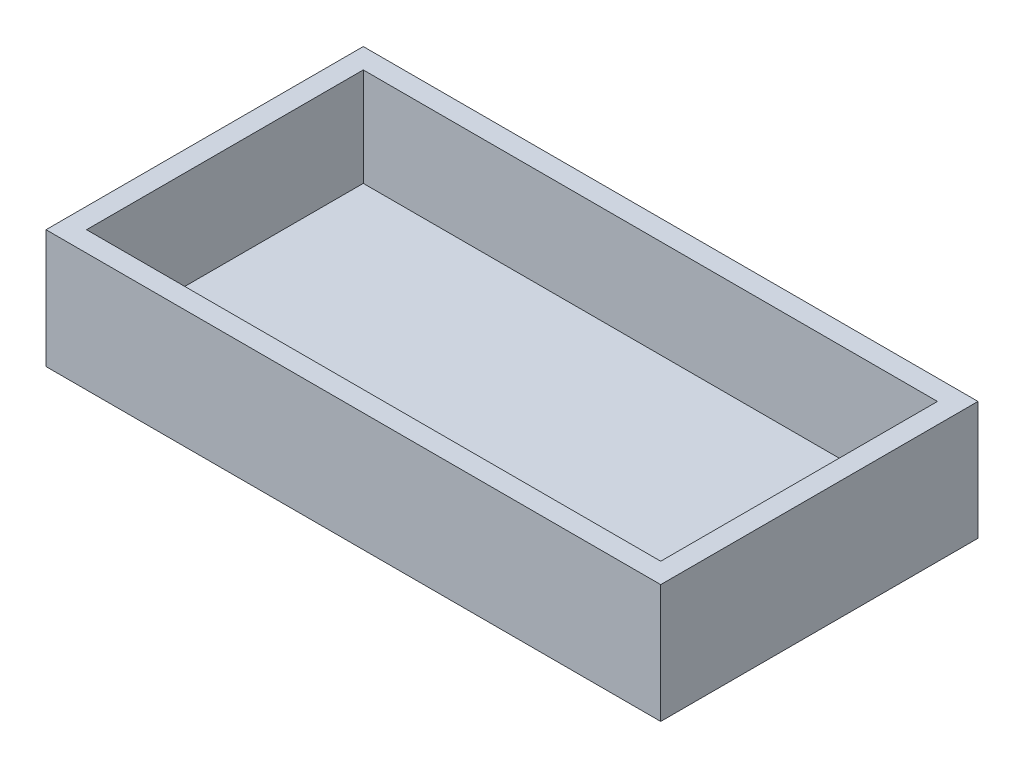
ISO-10303-21;
HEADER;
FILE_DESCRIPTION(('STEP AP214'),'2;1');
FILE_NAME('part.step','',(''),(''),'','','');
FILE_SCHEMA(('AUTOMOTIVE_DESIGN { 1 0 10303 214 1 1 1 1 }'));
ENDSEC;
DATA;
#1=APPLICATION_CONTEXT('core data for automotive mechanical design processes');
#2=APPLICATION_PROTOCOL_DEFINITION('international standard','automotive_design',2000,#1);
#3=PRODUCT_CONTEXT('',#1,'mechanical');
#4=PRODUCT('Part','Part','',(#3));
#5=PRODUCT_RELATED_PRODUCT_CATEGORY('part','',(#4));
#6=PRODUCT_DEFINITION_FORMATION('','',#4);
#7=PRODUCT_DEFINITION_CONTEXT('part definition',#1,'design');
#8=PRODUCT_DEFINITION('design','',#6,#7);
#9=PRODUCT_DEFINITION_SHAPE('','',#8);
#10=(LENGTH_UNIT() NAMED_UNIT(*) SI_UNIT(.MILLI.,.METRE.));
#11=(NAMED_UNIT(*) PLANE_ANGLE_UNIT() SI_UNIT($,.RADIAN.));
#12=(NAMED_UNIT(*) SI_UNIT($,.STERADIAN.) SOLID_ANGLE_UNIT());
#13=UNCERTAINTY_MEASURE_WITH_UNIT(LENGTH_MEASURE(1.E-05),#10,'distance_accuracy_value','');
#14=(GEOMETRIC_REPRESENTATION_CONTEXT(3) GLOBAL_UNCERTAINTY_ASSIGNED_CONTEXT((#13)) GLOBAL_UNIT_ASSIGNED_CONTEXT((#10,
#11,#12)) REPRESENTATION_CONTEXT('',''));
#15=CARTESIAN_POINT('',(0.,0.,0.));
#16=DIRECTION('',(0.,0.,1.));
#17=DIRECTION('',(1.,0.,0.));
#18=AXIS2_PLACEMENT_3D('',#15,#16,#17);
#19=CARTESIAN_POINT('',(0.,14.859,0.));
#20=DIRECTION('',(0.,-1.,0.));
#21=DIRECTION('',(0.,0.,-1.));
#22=AXIS2_PLACEMENT_3D('',#19,#20,#21);
#23=PLANE('',#22);
#24=DIRECTION('',(0.,0.,1.));
#25=VECTOR('',#24,1.);
#26=CARTESIAN_POINT('',(0.,14.859,0.));
#27=LINE('',#26,#25);
#28=CARTESIAN_POINT('',(0.,14.859,-39.7764));
#29=VERTEX_POINT('',#28);
#30=CARTESIAN_POINT('',(0.,14.859,0.));
#31=VERTEX_POINT('',#30);
#32=EDGE_CURVE('E142',#29,#31,#27,.T.);
#33=ORIENTED_EDGE('',*,*,#32,.T.);
#34=DIRECTION('',(1.,0.,0.));
#35=VECTOR('',#34,1.);
#36=CARTESIAN_POINT('',(0.,14.859,0.));
#37=LINE('',#36,#35);
#38=CARTESIAN_POINT('',(77.0636,14.859,0.));
#39=VERTEX_POINT('',#38);
#40=EDGE_CURVE('E86',#31,#39,#37,.T.);
#41=ORIENTED_EDGE('',*,*,#40,.T.);
#42=DIRECTION('',(0.,0.,-1.));
#43=VECTOR('',#42,1.);
#44=CARTESIAN_POINT('',(77.0636,14.859,0.));
#45=LINE('',#44,#43);
#46=CARTESIAN_POINT('',(77.0636,14.859,-39.7764));
#47=VERTEX_POINT('',#46);
#48=EDGE_CURVE('E145',#39,#47,#45,.T.);
#49=ORIENTED_EDGE('',*,*,#48,.T.);
#50=DIRECTION('',(-1.,0.,0.));
#51=VECTOR('',#50,1.);
#52=CARTESIAN_POINT('',(0.,14.859,-39.7764));
#53=LINE('',#52,#51);
#54=EDGE_CURVE('E58',#47,#29,#53,.T.);
#55=ORIENTED_EDGE('',*,*,#54,.T.);
#56=EDGE_LOOP('',(#33,#41,#49,#55));
#57=FACE_BOUND('',#56,.T.);
#58=DIRECTION('',(0.,0.,1.));
#59=VECTOR('',#58,1.);
#60=CARTESIAN_POINT('',(2.54,14.859,0.));
#61=LINE('',#60,#59);
#62=CARTESIAN_POINT('',(2.54,14.859,-37.2364));
#63=VERTEX_POINT('',#62);
#64=CARTESIAN_POINT('',(2.54,14.859,-2.54));
#65=VERTEX_POINT('',#64);
#66=EDGE_CURVE('E131',#63,#65,#61,.T.);
#67=ORIENTED_EDGE('',*,*,#66,.F.);
#68=DIRECTION('',(-1.,0.,0.));
#69=VECTOR('',#68,1.);
#70=CARTESIAN_POINT('',(0.,14.859,-37.2364));
#71=LINE('',#70,#69);
#72=CARTESIAN_POINT('',(74.5236,14.859,-37.2364));
#73=VERTEX_POINT('',#72);
#74=EDGE_CURVE('E140',#73,#63,#71,.T.);
#75=ORIENTED_EDGE('',*,*,#74,.F.);
#76=DIRECTION('',(0.,0.,-1.));
#77=VECTOR('',#76,1.);
#78=CARTESIAN_POINT('',(74.5236,14.859,0.));
#79=LINE('',#78,#77);
#80=CARTESIAN_POINT('',(74.5236,14.859,-2.54));
#81=VERTEX_POINT('',#80);
#82=EDGE_CURVE('E138',#81,#73,#79,.T.);
#83=ORIENTED_EDGE('',*,*,#82,.F.);
#84=DIRECTION('',(1.,0.,0.));
#85=VECTOR('',#84,1.);
#86=CARTESIAN_POINT('',(0.,14.859,-2.54));
#87=LINE('',#86,#85);
#88=EDGE_CURVE('E123',#65,#81,#87,.T.);
#89=ORIENTED_EDGE('',*,*,#88,.F.);
#90=EDGE_LOOP('',(#67,#75,#83,#89));
#91=FACE_BOUND('',#90,.T.);
#92=ADVANCED_FACE('F34',(#57,#91),#23,.F.);
#93=CARTESIAN_POINT('',(0.,14.859,0.));
#94=DIRECTION('',(1.,0.,0.));
#95=DIRECTION('',(0.,0.,-1.));
#96=AXIS2_PLACEMENT_3D('',#93,#94,#95);
#97=PLANE('',#96);
#98=DIRECTION('',(0.,0.,1.));
#99=VECTOR('',#98,1.);
#100=CARTESIAN_POINT('',(0.,0.,0.));
#101=LINE('',#100,#99);
#102=CARTESIAN_POINT('',(0.,0.,-39.7764));
#103=VERTEX_POINT('',#102);
#104=CARTESIAN_POINT('',(0.,0.,0.));
#105=VERTEX_POINT('',#104);
#106=EDGE_CURVE('E149',#103,#105,#101,.T.);
#107=ORIENTED_EDGE('',*,*,#106,.T.);
#108=DIRECTION('',(0.,-1.,0.));
#109=VECTOR('',#108,1.);
#110=CARTESIAN_POINT('',(0.,14.859,0.));
#111=LINE('',#110,#109);
#112=EDGE_CURVE('E11',#31,#105,#111,.T.);
#113=ORIENTED_EDGE('',*,*,#112,.F.);
#114=ORIENTED_EDGE('',*,*,#32,.F.);
#115=DIRECTION('',(0.,-1.,0.));
#116=VECTOR('',#115,1.);
#117=CARTESIAN_POINT('',(0.,14.859,-39.7764));
#118=LINE('',#117,#116);
#119=EDGE_CURVE('E148',#29,#103,#118,.T.);
#120=ORIENTED_EDGE('',*,*,#119,.T.);
#121=EDGE_LOOP('',(#107,#113,#114,#120));
#122=FACE_BOUND('',#121,.T.);
#123=ADVANCED_FACE('F36',(#122),#97,.F.);
#124=CARTESIAN_POINT('',(0.,14.859,0.));
#125=DIRECTION('',(0.,0.,-1.));
#126=DIRECTION('',(-1.,0.,0.));
#127=AXIS2_PLACEMENT_3D('',#124,#125,#126);
#128=PLANE('',#127);
#129=DIRECTION('',(1.,0.,0.));
#130=VECTOR('',#129,1.);
#131=CARTESIAN_POINT('',(0.,0.,0.));
#132=LINE('',#131,#130);
#133=CARTESIAN_POINT('',(77.0636,0.,0.));
#134=VERTEX_POINT('',#133);
#135=EDGE_CURVE('E152',#105,#134,#132,.T.);
#136=ORIENTED_EDGE('',*,*,#135,.T.);
#137=DIRECTION('',(0.,-1.,0.));
#138=VECTOR('',#137,1.);
#139=CARTESIAN_POINT('',(77.0636,14.859,0.));
#140=LINE('',#139,#138);
#141=EDGE_CURVE('E42',#39,#134,#140,.T.);
#142=ORIENTED_EDGE('',*,*,#141,.F.);
#143=ORIENTED_EDGE('',*,*,#40,.F.);
#144=ORIENTED_EDGE('',*,*,#112,.T.);
#145=EDGE_LOOP('',(#136,#142,#143,#144));
#146=FACE_BOUND('',#145,.T.);
#147=ADVANCED_FACE('F180',(#146),#128,.F.);
#148=CARTESIAN_POINT('',(77.0636,14.859,0.));
#149=DIRECTION('',(-1.,0.,0.));
#150=DIRECTION('',(0.,0.,1.));
#151=AXIS2_PLACEMENT_3D('',#148,#149,#150);
#152=PLANE('',#151);
#153=DIRECTION('',(0.,0.,-1.));
#154=VECTOR('',#153,1.);
#155=CARTESIAN_POINT('',(77.0636,0.,0.));
#156=LINE('',#155,#154);
#157=CARTESIAN_POINT('',(77.0636,0.,-39.7764));
#158=VERTEX_POINT('',#157);
#159=EDGE_CURVE('E154',#134,#158,#156,.T.);
#160=ORIENTED_EDGE('',*,*,#159,.T.);
#161=DIRECTION('',(0.,-1.,0.));
#162=VECTOR('',#161,1.);
#163=CARTESIAN_POINT('',(77.0636,14.859,-39.7764));
#164=LINE('',#163,#162);
#165=EDGE_CURVE('E158',#47,#158,#164,.T.);
#166=ORIENTED_EDGE('',*,*,#165,.F.);
#167=ORIENTED_EDGE('',*,*,#48,.F.);
#168=ORIENTED_EDGE('',*,*,#141,.T.);
#169=EDGE_LOOP('',(#160,#166,#167,#168));
#170=FACE_BOUND('',#169,.T.);
#171=ADVANCED_FACE('F163',(#170),#152,.F.);
#172=CARTESIAN_POINT('',(0.,14.859,-39.7764));
#173=DIRECTION('',(0.,0.,1.));
#174=DIRECTION('',(1.,0.,0.));
#175=AXIS2_PLACEMENT_3D('',#172,#173,#174);
#176=PLANE('',#175);
#177=DIRECTION('',(-1.,0.,0.));
#178=VECTOR('',#177,1.);
#179=CARTESIAN_POINT('',(0.,0.,-39.7764));
#180=LINE('',#179,#178);
#181=EDGE_CURVE('E79',#158,#103,#180,.T.);
#182=ORIENTED_EDGE('',*,*,#181,.T.);
#183=ORIENTED_EDGE('',*,*,#119,.F.);
#184=ORIENTED_EDGE('',*,*,#54,.F.);
#185=ORIENTED_EDGE('',*,*,#165,.T.);
#186=EDGE_LOOP('',(#182,#183,#184,#185));
#187=FACE_BOUND('',#186,.T.);
#188=ADVANCED_FACE('F171',(#187),#176,.F.);
#189=CARTESIAN_POINT('',(0.,0.,0.));
#190=DIRECTION('',(0.,-1.,0.));
#191=DIRECTION('',(0.,0.,-1.));
#192=AXIS2_PLACEMENT_3D('',#189,#190,#191);
#193=PLANE('',#192);
#194=ORIENTED_EDGE('',*,*,#106,.F.);
#195=ORIENTED_EDGE('',*,*,#181,.F.);
#196=ORIENTED_EDGE('',*,*,#159,.F.);
#197=ORIENTED_EDGE('',*,*,#135,.F.);
#198=EDGE_LOOP('',(#194,#195,#196,#197));
#199=FACE_BOUND('',#198,.T.);
#200=ADVANCED_FACE('F167',(#199),#193,.T.);
#201=CARTESIAN_POINT('',(2.54,14.859,0.));
#202=DIRECTION('',(1.,0.,0.));
#203=DIRECTION('',(0.,0.,-1.));
#204=AXIS2_PLACEMENT_3D('',#201,#202,#203);
#205=PLANE('',#204);
#206=DIRECTION('',(0.,0.,1.));
#207=VECTOR('',#206,1.);
#208=CARTESIAN_POINT('',(2.54,2.54,0.));
#209=LINE('',#208,#207);
#210=CARTESIAN_POINT('',(2.54,2.54,-37.2364));
#211=VERTEX_POINT('',#210);
#212=CARTESIAN_POINT('',(2.54,2.54,-2.54));
#213=VERTEX_POINT('',#212);
#214=EDGE_CURVE('E114',#211,#213,#209,.T.);
#215=ORIENTED_EDGE('',*,*,#214,.F.);
#216=DIRECTION('',(0.,-1.,0.));
#217=VECTOR('',#216,1.);
#218=CARTESIAN_POINT('',(2.54,14.859,-37.2364));
#219=LINE('',#218,#217);
#220=EDGE_CURVE('E134',#63,#211,#219,.T.);
#221=ORIENTED_EDGE('',*,*,#220,.F.);
#222=ORIENTED_EDGE('',*,*,#66,.T.);
#223=DIRECTION('',(0.,-1.,0.));
#224=VECTOR('',#223,1.);
#225=CARTESIAN_POINT('',(2.54,14.859,-2.54));
#226=LINE('',#225,#224);
#227=EDGE_CURVE('E126',#65,#213,#226,.T.);
#228=ORIENTED_EDGE('',*,*,#227,.T.);
#229=EDGE_LOOP('',(#215,#221,#222,#228));
#230=FACE_BOUND('',#229,.T.);
#231=ADVANCED_FACE('F178',(#230),#205,.T.);
#232=CARTESIAN_POINT('',(0.,14.859,-2.54));
#233=DIRECTION('',(0.,0.,-1.));
#234=DIRECTION('',(-1.,0.,0.));
#235=AXIS2_PLACEMENT_3D('',#232,#233,#234);
#236=PLANE('',#235);
#237=DIRECTION('',(1.,0.,0.));
#238=VECTOR('',#237,1.);
#239=CARTESIAN_POINT('',(0.,2.54,-2.54));
#240=LINE('',#239,#238);
#241=CARTESIAN_POINT('',(74.5236,2.54,-2.54));
#242=VERTEX_POINT('',#241);
#243=EDGE_CURVE('E108',#213,#242,#240,.T.);
#244=ORIENTED_EDGE('',*,*,#243,.F.);
#245=ORIENTED_EDGE('',*,*,#227,.F.);
#246=ORIENTED_EDGE('',*,*,#88,.T.);
#247=DIRECTION('',(0.,-1.,0.));
#248=VECTOR('',#247,1.);
#249=CARTESIAN_POINT('',(74.5236,14.859,-2.54));
#250=LINE('',#249,#248);
#251=EDGE_CURVE('E120',#81,#242,#250,.T.);
#252=ORIENTED_EDGE('',*,*,#251,.T.);
#253=EDGE_LOOP('',(#244,#245,#246,#252));
#254=FACE_BOUND('',#253,.T.);
#255=ADVANCED_FACE('F121',(#254),#236,.T.);
#256=CARTESIAN_POINT('',(74.5236,14.859,0.));
#257=DIRECTION('',(-1.,0.,0.));
#258=DIRECTION('',(0.,0.,1.));
#259=AXIS2_PLACEMENT_3D('',#256,#257,#258);
#260=PLANE('',#259);
#261=DIRECTION('',(0.,0.,-1.));
#262=VECTOR('',#261,1.);
#263=CARTESIAN_POINT('',(74.5236,2.54,0.));
#264=LINE('',#263,#262);
#265=CARTESIAN_POINT('',(74.5236,2.54,-37.2364));
#266=VERTEX_POINT('',#265);
#267=EDGE_CURVE('E112',#242,#266,#264,.T.);
#268=ORIENTED_EDGE('',*,*,#267,.F.);
#269=ORIENTED_EDGE('',*,*,#251,.F.);
#270=ORIENTED_EDGE('',*,*,#82,.T.);
#271=DIRECTION('',(0.,-1.,0.));
#272=VECTOR('',#271,1.);
#273=CARTESIAN_POINT('',(74.5236,14.859,-37.2364));
#274=LINE('',#273,#272);
#275=EDGE_CURVE('E49',#73,#266,#274,.T.);
#276=ORIENTED_EDGE('',*,*,#275,.T.);
#277=EDGE_LOOP('',(#268,#269,#270,#276));
#278=FACE_BOUND('',#277,.T.);
#279=ADVANCED_FACE('F128',(#278),#260,.T.);
#280=CARTESIAN_POINT('',(0.,14.859,-37.2364));
#281=DIRECTION('',(0.,0.,1.));
#282=DIRECTION('',(1.,0.,0.));
#283=AXIS2_PLACEMENT_3D('',#280,#281,#282);
#284=PLANE('',#283);
#285=DIRECTION('',(-1.,0.,0.));
#286=VECTOR('',#285,1.);
#287=CARTESIAN_POINT('',(0.,2.54,-37.2364));
#288=LINE('',#287,#286);
#289=EDGE_CURVE('E129',#266,#211,#288,.T.);
#290=ORIENTED_EDGE('',*,*,#289,.F.);
#291=ORIENTED_EDGE('',*,*,#275,.F.);
#292=ORIENTED_EDGE('',*,*,#74,.T.);
#293=ORIENTED_EDGE('',*,*,#220,.T.);
#294=EDGE_LOOP('',(#290,#291,#292,#293));
#295=FACE_BOUND('',#294,.T.);
#296=ADVANCED_FACE('F191',(#295),#284,.T.);
#297=CARTESIAN_POINT('',(0.,2.54,0.));
#298=DIRECTION('',(0.,-1.,0.));
#299=DIRECTION('',(0.,0.,-1.));
#300=AXIS2_PLACEMENT_3D('',#297,#298,#299);
#301=PLANE('',#300);
#302=ORIENTED_EDGE('',*,*,#214,.T.);
#303=ORIENTED_EDGE('',*,*,#243,.T.);
#304=ORIENTED_EDGE('',*,*,#267,.T.);
#305=ORIENTED_EDGE('',*,*,#289,.T.);
#306=EDGE_LOOP('',(#302,#303,#304,#305));
#307=FACE_BOUND('',#306,.T.);
#308=ADVANCED_FACE('F110',(#307),#301,.F.);
#309=CLOSED_SHELL('',(#92,#123,#147,#171,#188,#200,#231,#255,#279,#296,#308));
#310=MANIFOLD_SOLID_BREP('B2',#309);
#311=ADVANCED_BREP_SHAPE_REPRESENTATION('',(#18,#310),#14);
#312=SHAPE_DEFINITION_REPRESENTATION(#9,#311);
ENDSEC;
END-ISO-10303-21;
